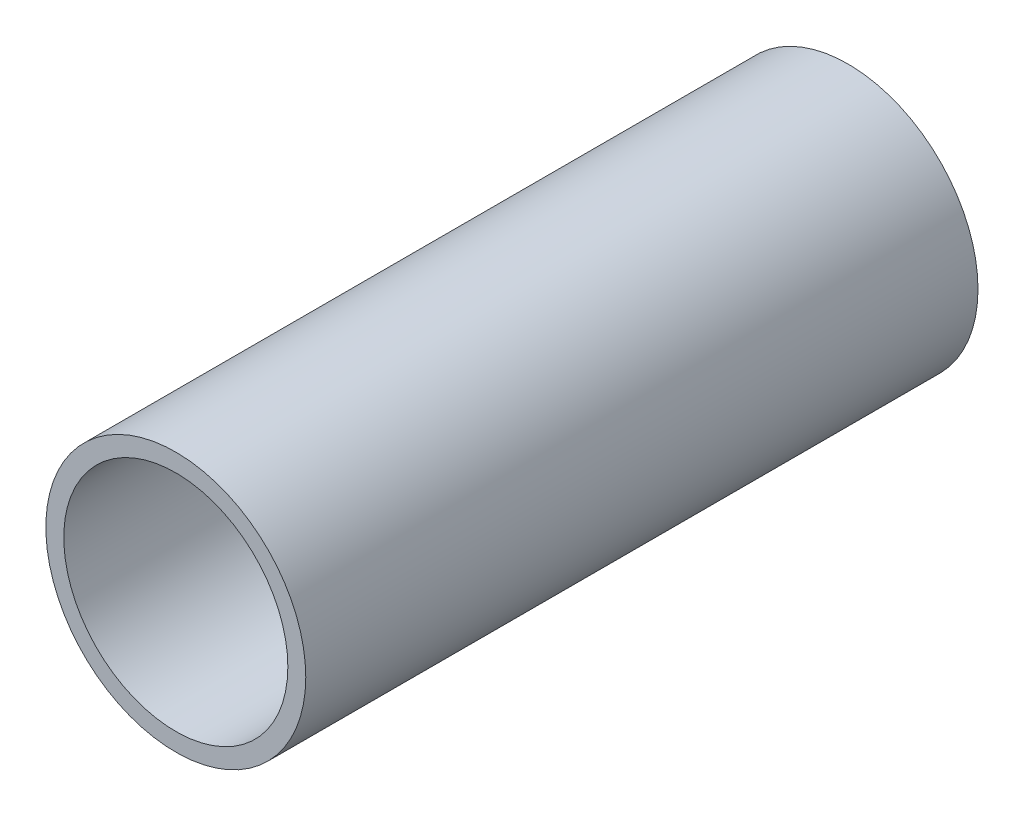
ISO-10303-21;
HEADER;
FILE_DESCRIPTION(('STEP AP214'),'2;1');
FILE_NAME('part.step','',(''),(''),'','','');
FILE_SCHEMA(('AUTOMOTIVE_DESIGN { 1 0 10303 214 1 1 1 1 }'));
ENDSEC;
DATA;
#1=APPLICATION_CONTEXT('core data for automotive mechanical design processes');
#2=APPLICATION_PROTOCOL_DEFINITION('international standard','automotive_design',2000,#1);
#3=PRODUCT_CONTEXT('',#1,'mechanical');
#4=PRODUCT('Part','Part','',(#3));
#5=PRODUCT_RELATED_PRODUCT_CATEGORY('part','',(#4));
#6=PRODUCT_DEFINITION_FORMATION('','',#4);
#7=PRODUCT_DEFINITION_CONTEXT('part definition',#1,'design');
#8=PRODUCT_DEFINITION('design','',#6,#7);
#9=PRODUCT_DEFINITION_SHAPE('','',#8);
#10=(LENGTH_UNIT() NAMED_UNIT(*) SI_UNIT(.MILLI.,.METRE.));
#11=(NAMED_UNIT(*) PLANE_ANGLE_UNIT() SI_UNIT($,.RADIAN.));
#12=(NAMED_UNIT(*) SI_UNIT($,.STERADIAN.) SOLID_ANGLE_UNIT());
#13=UNCERTAINTY_MEASURE_WITH_UNIT(LENGTH_MEASURE(1.E-05),#10,'distance_accuracy_value','');
#14=(GEOMETRIC_REPRESENTATION_CONTEXT(3) GLOBAL_UNCERTAINTY_ASSIGNED_CONTEXT((#13)) GLOBAL_UNIT_ASSIGNED_CONTEXT((#10,
#11,#12)) REPRESENTATION_CONTEXT('',''));
#15=CARTESIAN_POINT('',(0.,0.,0.));
#16=DIRECTION('',(0.,0.,1.));
#17=DIRECTION('',(1.,0.,0.));
#18=AXIS2_PLACEMENT_3D('',#15,#16,#17);
#19=CARTESIAN_POINT('',(0.,0.,9.));
#20=DIRECTION('',(0.,0.,1.));
#21=DIRECTION('',(1.,0.,0.));
#22=AXIS2_PLACEMENT_3D('',#19,#20,#21);
#23=PLANE('',#22);
#24=CARTESIAN_POINT('',(0.,0.,9.));
#25=DIRECTION('',(0.,0.,1.));
#26=DIRECTION('',(1.,0.,0.));
#27=AXIS2_PLACEMENT_3D('',#24,#25,#26);
#28=CIRCLE('',#27,9.85);
#29=CARTESIAN_POINT('',(9.85,0.,9.));
#30=VERTEX_POINT('',#29);
#31=EDGE_CURVE('E46',#30,#30,#28,.T.);
#32=ORIENTED_EDGE('',*,*,#31,.F.);
#33=EDGE_LOOP('',(#32));
#34=FACE_BOUND('',#33,.T.);
#35=CARTESIAN_POINT('',(0.,0.,9.));
#36=DIRECTION('',(0.,0.,1.));
#37=DIRECTION('',(1.,0.,0.));
#38=AXIS2_PLACEMENT_3D('',#35,#36,#37);
#39=CIRCLE('',#38,12.5);
#40=CARTESIAN_POINT('',(12.5,0.,9.));
#41=VERTEX_POINT('',#40);
#42=EDGE_CURVE('E10',#41,#41,#39,.F.);
#43=ORIENTED_EDGE('',*,*,#42,.F.);
#44=EDGE_LOOP('',(#43));
#45=FACE_BOUND('',#44,.T.);
#46=ADVANCED_FACE('F38',(#34,#45),#23,.T.);
#47=CARTESIAN_POINT('',(0.,0.,-9.));
#48=DIRECTION('',(0.,0.,1.));
#49=DIRECTION('',(1.,0.,0.));
#50=AXIS2_PLACEMENT_3D('',#47,#48,#49);
#51=PLANE('',#50);
#52=CARTESIAN_POINT('',(0.,0.,-9.));
#53=DIRECTION('',(0.,0.,1.));
#54=DIRECTION('',(1.,0.,0.));
#55=AXIS2_PLACEMENT_3D('',#52,#53,#54);
#56=CIRCLE('',#55,9.85);
#57=CARTESIAN_POINT('',(9.85,0.,-9.));
#58=VERTEX_POINT('',#57);
#59=EDGE_CURVE('E51',#58,#58,#56,.T.);
#60=ORIENTED_EDGE('',*,*,#59,.T.);
#61=EDGE_LOOP('',(#60));
#62=FACE_BOUND('',#61,.T.);
#63=CARTESIAN_POINT('',(0.,0.,-9.));
#64=DIRECTION('',(0.,0.,1.));
#65=DIRECTION('',(1.,0.,0.));
#66=AXIS2_PLACEMENT_3D('',#63,#64,#65);
#67=CIRCLE('',#66,12.5);
#68=CARTESIAN_POINT('',(12.5,0.,-9.));
#69=VERTEX_POINT('',#68);
#70=EDGE_CURVE('E42',#69,#69,#67,.F.);
#71=ORIENTED_EDGE('',*,*,#70,.T.);
#72=EDGE_LOOP('',(#71));
#73=FACE_BOUND('',#72,.T.);
#74=ADVANCED_FACE('F90',(#62,#73),#51,.F.);
#75=CARTESIAN_POINT('',(0.,0.,9.));
#76=DIRECTION('',(0.,0.,-1.));
#77=DIRECTION('',(-1.,0.,0.));
#78=AXIS2_PLACEMENT_3D('',#75,#76,#77);
#79=CYLINDRICAL_SURFACE('',#78,9.85);
#80=ORIENTED_EDGE('',*,*,#31,.T.);
#81=EDGE_LOOP('',(#80));
#82=FACE_BOUND('',#81,.T.);
#83=ORIENTED_EDGE('',*,*,#59,.F.);
#84=EDGE_LOOP('',(#83));
#85=FACE_BOUND('',#84,.T.);
#86=ADVANCED_FACE('F40',(#82,#85),#79,.F.);
#87=CARTESIAN_POINT('',(0.,0.,-37.5));
#88=DIRECTION('',(0.,0.,1.));
#89=DIRECTION('',(1.,0.,0.));
#90=AXIS2_PLACEMENT_3D('',#87,#88,#89);
#91=PLANE('',#90);
#92=CARTESIAN_POINT('',(0.,0.,-37.5));
#93=DIRECTION('',(0.,0.,1.));
#94=DIRECTION('',(1.,0.,0.));
#95=AXIS2_PLACEMENT_3D('',#92,#93,#94);
#96=CIRCLE('',#95,14.5);
#97=CARTESIAN_POINT('',(14.5,0.,-37.5));
#98=VERTEX_POINT('',#97);
#99=EDGE_CURVE('E54',#98,#98,#96,.T.);
#100=ORIENTED_EDGE('',*,*,#99,.F.);
#101=EDGE_LOOP('',(#100));
#102=FACE_BOUND('',#101,.T.);
#103=CARTESIAN_POINT('',(0.,0.,-37.5));
#104=DIRECTION('',(0.,0.,1.));
#105=DIRECTION('',(1.,0.,0.));
#106=AXIS2_PLACEMENT_3D('',#103,#104,#105);
#107=CIRCLE('',#106,12.5);
#108=CARTESIAN_POINT('',(12.5,0.,-37.5));
#109=VERTEX_POINT('',#108);
#110=EDGE_CURVE('E69',#109,#109,#107,.T.);
#111=ORIENTED_EDGE('',*,*,#110,.T.);
#112=EDGE_LOOP('',(#111));
#113=FACE_BOUND('',#112,.T.);
#114=ADVANCED_FACE('F100',(#102,#113),#91,.F.);
#115=CARTESIAN_POINT('',(0.,0.,37.5));
#116=DIRECTION('',(0.,0.,-1.));
#117=DIRECTION('',(-1.,0.,0.));
#118=AXIS2_PLACEMENT_3D('',#115,#116,#117);
#119=CYLINDRICAL_SURFACE('',#118,12.5);
#120=ORIENTED_EDGE('',*,*,#110,.F.);
#121=EDGE_LOOP('',(#120));
#122=FACE_BOUND('',#121,.T.);
#123=ORIENTED_EDGE('',*,*,#70,.F.);
#124=EDGE_LOOP('',(#123));
#125=FACE_BOUND('',#124,.T.);
#126=ADVANCED_FACE('F86',(#122,#125),#119,.F.);
#127=CARTESIAN_POINT('',(0.,0.,9.));
#128=DIRECTION('',(0.,0.,-1.));
#129=DIRECTION('',(-1.,0.,0.));
#130=AXIS2_PLACEMENT_3D('',#127,#128,#129);
#131=CYLINDRICAL_SURFACE('',#130,14.5);
#132=ORIENTED_EDGE('',*,*,#99,.T.);
#133=EDGE_LOOP('',(#132));
#134=FACE_BOUND('',#133,.T.);
#135=CARTESIAN_POINT('',(0.,0.,37.5));
#136=DIRECTION('',(0.,0.,1.));
#137=DIRECTION('',(1.,0.,0.));
#138=AXIS2_PLACEMENT_3D('',#135,#136,#137);
#139=CIRCLE('',#138,14.5);
#140=CARTESIAN_POINT('',(14.5,0.,37.5));
#141=VERTEX_POINT('',#140);
#142=EDGE_CURVE('E60',#141,#141,#139,.T.);
#143=ORIENTED_EDGE('',*,*,#142,.F.);
#144=EDGE_LOOP('',(#143));
#145=FACE_BOUND('',#144,.T.);
#146=ADVANCED_FACE('F79',(#134,#145),#131,.T.);
#147=CARTESIAN_POINT('',(0.,0.,37.5));
#148=DIRECTION('',(0.,0.,1.));
#149=DIRECTION('',(1.,0.,0.));
#150=AXIS2_PLACEMENT_3D('',#147,#148,#149);
#151=PLANE('',#150);
#152=ORIENTED_EDGE('',*,*,#142,.T.);
#153=EDGE_LOOP('',(#152));
#154=FACE_BOUND('',#153,.T.);
#155=CARTESIAN_POINT('',(0.,0.,37.5));
#156=DIRECTION('',(0.,0.,1.));
#157=DIRECTION('',(1.,0.,0.));
#158=AXIS2_PLACEMENT_3D('',#155,#156,#157);
#159=CIRCLE('',#158,12.5);
#160=CARTESIAN_POINT('',(12.5,0.,37.5));
#161=VERTEX_POINT('',#160);
#162=EDGE_CURVE('E67',#161,#161,#159,.T.);
#163=ORIENTED_EDGE('',*,*,#162,.F.);
#164=EDGE_LOOP('',(#163));
#165=FACE_BOUND('',#164,.T.);
#166=ADVANCED_FACE('F77',(#154,#165),#151,.T.);
#167=ORIENTED_EDGE('',*,*,#42,.T.);
#168=EDGE_LOOP('',(#167));
#169=FACE_BOUND('',#168,.T.);
#170=ORIENTED_EDGE('',*,*,#162,.T.);
#171=EDGE_LOOP('',(#170));
#172=FACE_BOUND('',#171,.T.);
#173=ADVANCED_FACE('F75',(#169,#172),#119,.F.);
#174=CLOSED_SHELL('',(#46,#74,#86,#114,#126,#146,#166,#173));
#175=MANIFOLD_SOLID_BREP('B2',#174);
#176=ADVANCED_BREP_SHAPE_REPRESENTATION('',(#18,#175),#14);
#177=SHAPE_DEFINITION_REPRESENTATION(#9,#176);
ENDSEC;
END-ISO-10303-21;
